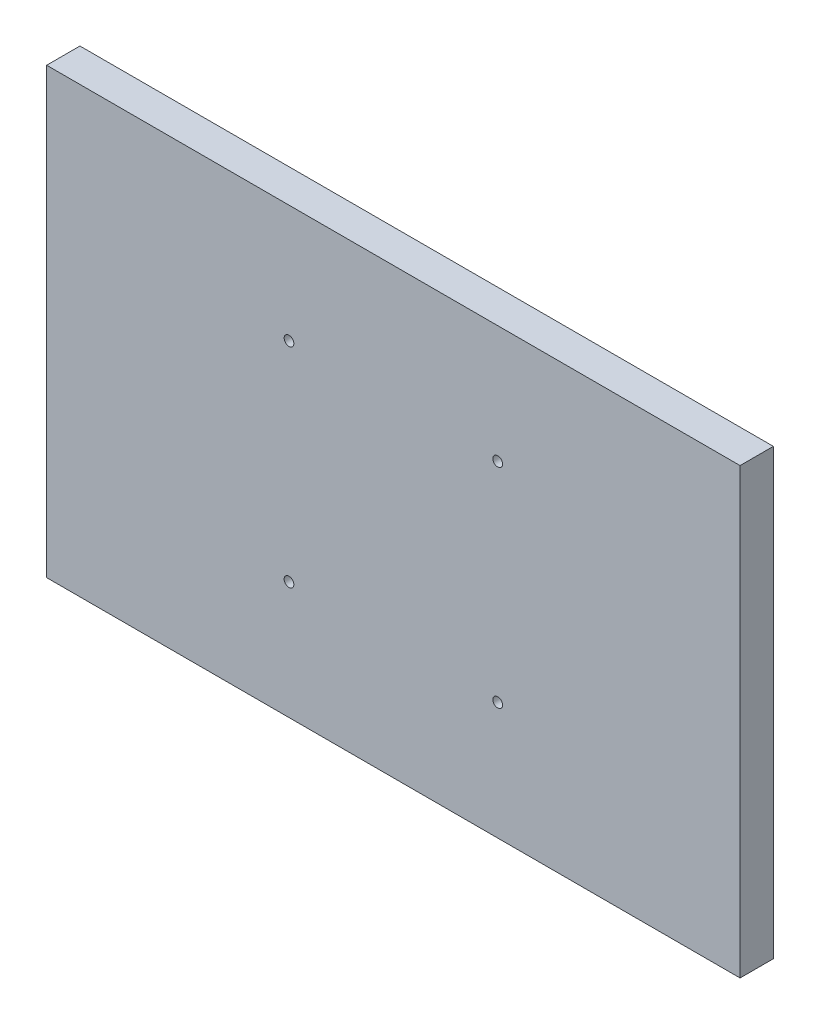
ISO-10303-21;
HEADER;
FILE_DESCRIPTION(('STEP AP214'),'2;1');
FILE_NAME('part.step','',(''),(''),'','','');
FILE_SCHEMA(('AUTOMOTIVE_DESIGN { 1 0 10303 214 1 1 1 1 }'));
ENDSEC;
DATA;
#1=APPLICATION_CONTEXT('core data for automotive mechanical design processes');
#2=APPLICATION_PROTOCOL_DEFINITION('international standard','automotive_design',2000,#1);
#3=PRODUCT_CONTEXT('',#1,'mechanical');
#4=PRODUCT('Part','Part','',(#3));
#5=PRODUCT_RELATED_PRODUCT_CATEGORY('part','',(#4));
#6=PRODUCT_DEFINITION_FORMATION('','',#4);
#7=PRODUCT_DEFINITION_CONTEXT('part definition',#1,'design');
#8=PRODUCT_DEFINITION('design','',#6,#7);
#9=PRODUCT_DEFINITION_SHAPE('','',#8);
#10=(LENGTH_UNIT() NAMED_UNIT(*) SI_UNIT(.MILLI.,.METRE.));
#11=(NAMED_UNIT(*) PLANE_ANGLE_UNIT() SI_UNIT($,.RADIAN.));
#12=(NAMED_UNIT(*) SI_UNIT($,.STERADIAN.) SOLID_ANGLE_UNIT());
#13=UNCERTAINTY_MEASURE_WITH_UNIT(LENGTH_MEASURE(1.E-05),#10,'distance_accuracy_value','');
#14=(GEOMETRIC_REPRESENTATION_CONTEXT(3) GLOBAL_UNCERTAINTY_ASSIGNED_CONTEXT((#13)) GLOBAL_UNIT_ASSIGNED_CONTEXT((#10,
#11,#12)) REPRESENTATION_CONTEXT('',''));
#15=CARTESIAN_POINT('',(0.,0.,0.));
#16=DIRECTION('',(0.,0.,1.));
#17=DIRECTION('',(1.,0.,0.));
#18=AXIS2_PLACEMENT_3D('',#15,#16,#17);
#19=CARTESIAN_POINT('',(0.,0.,12.));
#20=DIRECTION('',(0.,0.,1.));
#21=DIRECTION('',(1.,0.,0.));
#22=AXIS2_PLACEMENT_3D('',#19,#20,#21);
#23=PLANE('',#22);
#24=CARTESIAN_POINT('',(-37.625,-37.625,12.));
#25=DIRECTION('',(0.,0.,1.));
#26=DIRECTION('',(1.,0.,0.));
#27=AXIS2_PLACEMENT_3D('',#24,#25,#26);
#28=CIRCLE('',#27,1.75000000000004);
#29=CARTESIAN_POINT('',(-35.875,-37.625,12.));
#30=VERTEX_POINT('',#29);
#31=EDGE_CURVE('E124',#30,#30,#28,.T.);
#32=ORIENTED_EDGE('',*,*,#31,.F.);
#33=EDGE_LOOP('',(#32));
#34=FACE_BOUND('',#33,.T.);
#35=CARTESIAN_POINT('',(37.625,37.625,12.));
#36=DIRECTION('',(0.,0.,1.));
#37=DIRECTION('',(1.,0.,0.));
#38=AXIS2_PLACEMENT_3D('',#35,#36,#37);
#39=CIRCLE('',#38,1.75000000000001);
#40=CARTESIAN_POINT('',(39.375,37.625,12.));
#41=VERTEX_POINT('',#40);
#42=EDGE_CURVE('E103',#41,#41,#39,.T.);
#43=ORIENTED_EDGE('',*,*,#42,.F.);
#44=EDGE_LOOP('',(#43));
#45=FACE_BOUND('',#44,.T.);
#46=DIRECTION('',(0.,1.,0.));
#47=VECTOR('',#46,1.);
#48=CARTESIAN_POINT('',(125.,80.,12.));
#49=LINE('',#48,#47);
#50=CARTESIAN_POINT('',(125.,-80.,12.));
#51=VERTEX_POINT('',#50);
#52=CARTESIAN_POINT('',(125.,80.,12.));
#53=VERTEX_POINT('',#52);
#54=EDGE_CURVE('E88',#51,#53,#49,.T.);
#55=ORIENTED_EDGE('',*,*,#54,.T.);
#56=DIRECTION('',(-1.,0.,0.));
#57=VECTOR('',#56,1.);
#58=CARTESIAN_POINT('',(-125.,80.,12.));
#59=LINE('',#58,#57);
#60=CARTESIAN_POINT('',(-125.,80.,12.));
#61=VERTEX_POINT('',#60);
#62=EDGE_CURVE('E83',#53,#61,#59,.T.);
#63=ORIENTED_EDGE('',*,*,#62,.T.);
#64=DIRECTION('',(0.,-1.,0.));
#65=VECTOR('',#64,1.);
#66=CARTESIAN_POINT('',(-125.,80.,12.));
#67=LINE('',#66,#65);
#68=CARTESIAN_POINT('',(-125.,-80.,12.));
#69=VERTEX_POINT('',#68);
#70=EDGE_CURVE('E86',#61,#69,#67,.T.);
#71=ORIENTED_EDGE('',*,*,#70,.T.);
#72=DIRECTION('',(1.,0.,0.));
#73=VECTOR('',#72,1.);
#74=CARTESIAN_POINT('',(-125.,-80.,12.));
#75=LINE('',#74,#73);
#76=EDGE_CURVE('E53',#69,#51,#75,.T.);
#77=ORIENTED_EDGE('',*,*,#76,.T.);
#78=EDGE_LOOP('',(#55,#63,#71,#77));
#79=FACE_BOUND('',#78,.T.);
#80=CARTESIAN_POINT('',(37.625,-37.625,12.));
#81=DIRECTION('',(0.,0.,1.));
#82=DIRECTION('',(1.,0.,0.));
#83=AXIS2_PLACEMENT_3D('',#80,#81,#82);
#84=CIRCLE('',#83,1.75000000000001);
#85=CARTESIAN_POINT('',(39.375,-37.625,12.));
#86=VERTEX_POINT('',#85);
#87=EDGE_CURVE('E118',#86,#86,#84,.T.);
#88=ORIENTED_EDGE('',*,*,#87,.F.);
#89=EDGE_LOOP('',(#88));
#90=FACE_BOUND('',#89,.T.);
#91=CARTESIAN_POINT('',(-37.625,37.625,12.));
#92=DIRECTION('',(0.,0.,1.));
#93=DIRECTION('',(1.,0.,0.));
#94=AXIS2_PLACEMENT_3D('',#91,#92,#93);
#95=CIRCLE('',#94,1.74999999999998);
#96=CARTESIAN_POINT('',(-35.875,37.625,12.));
#97=VERTEX_POINT('',#96);
#98=EDGE_CURVE('E130',#97,#97,#95,.T.);
#99=ORIENTED_EDGE('',*,*,#98,.F.);
#100=EDGE_LOOP('',(#99));
#101=FACE_BOUND('',#100,.T.);
#102=ADVANCED_FACE('F36',(#34,#45,#79,#90,#101),#23,.T.);
#103=CARTESIAN_POINT('',(0.,0.,0.));
#104=DIRECTION('',(0.,0.,1.));
#105=DIRECTION('',(1.,0.,0.));
#106=AXIS2_PLACEMENT_3D('',#103,#104,#105);
#107=PLANE('',#106);
#108=DIRECTION('',(0.,1.,0.));
#109=VECTOR('',#108,1.);
#110=CARTESIAN_POINT('',(125.,80.,0.));
#111=LINE('',#110,#109);
#112=CARTESIAN_POINT('',(125.,-80.,0.));
#113=VERTEX_POINT('',#112);
#114=CARTESIAN_POINT('',(125.,80.,0.));
#115=VERTEX_POINT('',#114);
#116=EDGE_CURVE('E100',#113,#115,#111,.T.);
#117=ORIENTED_EDGE('',*,*,#116,.F.);
#118=DIRECTION('',(1.,0.,0.));
#119=VECTOR('',#118,1.);
#120=CARTESIAN_POINT('',(-125.,-80.,0.));
#121=LINE('',#120,#119);
#122=CARTESIAN_POINT('',(-125.,-80.,0.));
#123=VERTEX_POINT('',#122);
#124=EDGE_CURVE('E76',#123,#113,#121,.T.);
#125=ORIENTED_EDGE('',*,*,#124,.F.);
#126=DIRECTION('',(0.,-1.,0.));
#127=VECTOR('',#126,1.);
#128=CARTESIAN_POINT('',(-125.,80.,0.));
#129=LINE('',#128,#127);
#130=CARTESIAN_POINT('',(-125.,80.,0.));
#131=VERTEX_POINT('',#130);
#132=EDGE_CURVE('E70',#131,#123,#129,.T.);
#133=ORIENTED_EDGE('',*,*,#132,.F.);
#134=DIRECTION('',(-1.,0.,0.));
#135=VECTOR('',#134,1.);
#136=CARTESIAN_POINT('',(-125.,80.,0.));
#137=LINE('',#136,#135);
#138=EDGE_CURVE('E92',#115,#131,#137,.T.);
#139=ORIENTED_EDGE('',*,*,#138,.F.);
#140=EDGE_LOOP('',(#117,#125,#133,#139));
#141=FACE_BOUND('',#140,.T.);
#142=CARTESIAN_POINT('',(37.625,37.625,0.));
#143=DIRECTION('',(0.,0.,1.));
#144=DIRECTION('',(1.,0.,0.));
#145=AXIS2_PLACEMENT_3D('',#142,#143,#144);
#146=CIRCLE('',#145,1.75000000000001);
#147=CARTESIAN_POINT('',(39.375,37.625,0.));
#148=VERTEX_POINT('',#147);
#149=EDGE_CURVE('E115',#148,#148,#146,.T.);
#150=ORIENTED_EDGE('',*,*,#149,.T.);
#151=EDGE_LOOP('',(#150));
#152=FACE_BOUND('',#151,.T.);
#153=CARTESIAN_POINT('',(37.625,-37.625,0.));
#154=DIRECTION('',(0.,0.,1.));
#155=DIRECTION('',(1.,0.,0.));
#156=AXIS2_PLACEMENT_3D('',#153,#154,#155);
#157=CIRCLE('',#156,1.75000000000001);
#158=CARTESIAN_POINT('',(39.375,-37.625,0.));
#159=VERTEX_POINT('',#158);
#160=EDGE_CURVE('E121',#159,#159,#157,.T.);
#161=ORIENTED_EDGE('',*,*,#160,.T.);
#162=EDGE_LOOP('',(#161));
#163=FACE_BOUND('',#162,.T.);
#164=CARTESIAN_POINT('',(-37.625,-37.625,0.));
#165=DIRECTION('',(0.,0.,1.));
#166=DIRECTION('',(1.,0.,0.));
#167=AXIS2_PLACEMENT_3D('',#164,#165,#166);
#168=CIRCLE('',#167,1.75000000000004);
#169=CARTESIAN_POINT('',(-35.875,-37.625,0.));
#170=VERTEX_POINT('',#169);
#171=EDGE_CURVE('E127',#170,#170,#168,.T.);
#172=ORIENTED_EDGE('',*,*,#171,.T.);
#173=EDGE_LOOP('',(#172));
#174=FACE_BOUND('',#173,.T.);
#175=CARTESIAN_POINT('',(-37.625,37.625,0.));
#176=DIRECTION('',(0.,0.,1.));
#177=DIRECTION('',(1.,0.,0.));
#178=AXIS2_PLACEMENT_3D('',#175,#176,#177);
#179=CIRCLE('',#178,1.74999999999998);
#180=CARTESIAN_POINT('',(-35.875,37.625,0.));
#181=VERTEX_POINT('',#180);
#182=EDGE_CURVE('E133',#181,#181,#179,.T.);
#183=ORIENTED_EDGE('',*,*,#182,.T.);
#184=EDGE_LOOP('',(#183));
#185=FACE_BOUND('',#184,.T.);
#186=ADVANCED_FACE('F111',(#141,#152,#163,#174,#185),#107,.F.);
#187=CARTESIAN_POINT('',(125.,80.,12.));
#188=DIRECTION('',(-1.,0.,0.));
#189=DIRECTION('',(0.,0.,1.));
#190=AXIS2_PLACEMENT_3D('',#187,#188,#189);
#191=PLANE('',#190);
#192=ORIENTED_EDGE('',*,*,#116,.T.);
#193=DIRECTION('',(0.,0.,-1.));
#194=VECTOR('',#193,1.);
#195=CARTESIAN_POINT('',(125.,80.,12.));
#196=LINE('',#195,#194);
#197=EDGE_CURVE('E11',#53,#115,#196,.T.);
#198=ORIENTED_EDGE('',*,*,#197,.F.);
#199=ORIENTED_EDGE('',*,*,#54,.F.);
#200=DIRECTION('',(0.,0.,-1.));
#201=VECTOR('',#200,1.);
#202=CARTESIAN_POINT('',(125.,-80.,12.));
#203=LINE('',#202,#201);
#204=EDGE_CURVE('E96',#51,#113,#203,.T.);
#205=ORIENTED_EDGE('',*,*,#204,.T.);
#206=EDGE_LOOP('',(#192,#198,#199,#205));
#207=FACE_BOUND('',#206,.T.);
#208=ADVANCED_FACE('F38',(#207),#191,.F.);
#209=CARTESIAN_POINT('',(-125.,80.,12.));
#210=DIRECTION('',(0.,-1.,0.));
#211=DIRECTION('',(0.,0.,-1.));
#212=AXIS2_PLACEMENT_3D('',#209,#210,#211);
#213=PLANE('',#212);
#214=ORIENTED_EDGE('',*,*,#138,.T.);
#215=DIRECTION('',(0.,0.,-1.));
#216=VECTOR('',#215,1.);
#217=CARTESIAN_POINT('',(-125.,80.,12.));
#218=LINE('',#217,#216);
#219=EDGE_CURVE('E45',#61,#131,#218,.T.);
#220=ORIENTED_EDGE('',*,*,#219,.F.);
#221=ORIENTED_EDGE('',*,*,#62,.F.);
#222=ORIENTED_EDGE('',*,*,#197,.T.);
#223=EDGE_LOOP('',(#214,#220,#221,#222));
#224=FACE_BOUND('',#223,.T.);
#225=ADVANCED_FACE('F91',(#224),#213,.F.);
#226=CARTESIAN_POINT('',(-125.,80.,12.));
#227=DIRECTION('',(1.,0.,0.));
#228=DIRECTION('',(0.,1.,0.));
#229=AXIS2_PLACEMENT_3D('',#226,#227,#228);
#230=PLANE('',#229);
#231=ORIENTED_EDGE('',*,*,#132,.T.);
#232=DIRECTION('',(0.,0.,-1.));
#233=VECTOR('',#232,1.);
#234=CARTESIAN_POINT('',(-125.,-80.,12.));
#235=LINE('',#234,#233);
#236=EDGE_CURVE('E93',#69,#123,#235,.T.);
#237=ORIENTED_EDGE('',*,*,#236,.F.);
#238=ORIENTED_EDGE('',*,*,#70,.F.);
#239=ORIENTED_EDGE('',*,*,#219,.T.);
#240=EDGE_LOOP('',(#231,#237,#238,#239));
#241=FACE_BOUND('',#240,.T.);
#242=ADVANCED_FACE('F94',(#241),#230,.F.);
#243=CARTESIAN_POINT('',(-125.,-80.,12.));
#244=DIRECTION('',(0.,1.,0.));
#245=DIRECTION('',(0.,0.,1.));
#246=AXIS2_PLACEMENT_3D('',#243,#244,#245);
#247=PLANE('',#246);
#248=ORIENTED_EDGE('',*,*,#124,.T.);
#249=ORIENTED_EDGE('',*,*,#204,.F.);
#250=ORIENTED_EDGE('',*,*,#76,.F.);
#251=ORIENTED_EDGE('',*,*,#236,.T.);
#252=EDGE_LOOP('',(#248,#249,#250,#251));
#253=FACE_BOUND('',#252,.T.);
#254=ADVANCED_FACE('F108',(#253),#247,.F.);
#255=CARTESIAN_POINT('',(37.625,37.625,12.));
#256=DIRECTION('',(0.,0.,-1.));
#257=DIRECTION('',(-1.,0.,0.));
#258=AXIS2_PLACEMENT_3D('',#255,#256,#257);
#259=CYLINDRICAL_SURFACE('',#258,1.75000000000001);
#260=ORIENTED_EDGE('',*,*,#42,.T.);
#261=EDGE_LOOP('',(#260));
#262=FACE_BOUND('',#261,.T.);
#263=ORIENTED_EDGE('',*,*,#149,.F.);
#264=EDGE_LOOP('',(#263));
#265=FACE_BOUND('',#264,.T.);
#266=ADVANCED_FACE('F152',(#262,#265),#259,.F.);
#267=CARTESIAN_POINT('',(37.625,-37.625,12.));
#268=DIRECTION('',(0.,0.,-1.));
#269=DIRECTION('',(-1.,0.,0.));
#270=AXIS2_PLACEMENT_3D('',#267,#268,#269);
#271=CYLINDRICAL_SURFACE('',#270,1.75000000000001);
#272=ORIENTED_EDGE('',*,*,#87,.T.);
#273=EDGE_LOOP('',(#272));
#274=FACE_BOUND('',#273,.T.);
#275=ORIENTED_EDGE('',*,*,#160,.F.);
#276=EDGE_LOOP('',(#275));
#277=FACE_BOUND('',#276,.T.);
#278=ADVANCED_FACE('F213',(#274,#277),#271,.F.);
#279=CARTESIAN_POINT('',(-37.625,-37.625,12.));
#280=DIRECTION('',(0.,0.,-1.));
#281=DIRECTION('',(-1.,0.,0.));
#282=AXIS2_PLACEMENT_3D('',#279,#280,#281);
#283=CYLINDRICAL_SURFACE('',#282,1.75000000000004);
#284=ORIENTED_EDGE('',*,*,#31,.T.);
#285=EDGE_LOOP('',(#284));
#286=FACE_BOUND('',#285,.T.);
#287=ORIENTED_EDGE('',*,*,#171,.F.);
#288=EDGE_LOOP('',(#287));
#289=FACE_BOUND('',#288,.T.);
#290=ADVANCED_FACE('F221',(#286,#289),#283,.F.);
#291=CARTESIAN_POINT('',(-37.625,37.625,12.));
#292=DIRECTION('',(0.,0.,-1.));
#293=DIRECTION('',(-1.,0.,0.));
#294=AXIS2_PLACEMENT_3D('',#291,#292,#293);
#295=CYLINDRICAL_SURFACE('',#294,1.74999999999998);
#296=ORIENTED_EDGE('',*,*,#98,.T.);
#297=EDGE_LOOP('',(#296));
#298=FACE_BOUND('',#297,.T.);
#299=ORIENTED_EDGE('',*,*,#182,.F.);
#300=EDGE_LOOP('',(#299));
#301=FACE_BOUND('',#300,.T.);
#302=ADVANCED_FACE('F139',(#298,#301),#295,.F.);
#303=CLOSED_SHELL('',(#102,#186,#208,#225,#242,#254,#266,#278,#290,#302));
#304=MANIFOLD_SOLID_BREP('B2',#303);
#305=ADVANCED_BREP_SHAPE_REPRESENTATION('',(#18,#304),#14);
#306=SHAPE_DEFINITION_REPRESENTATION(#9,#305);
ENDSEC;
END-ISO-10303-21;
